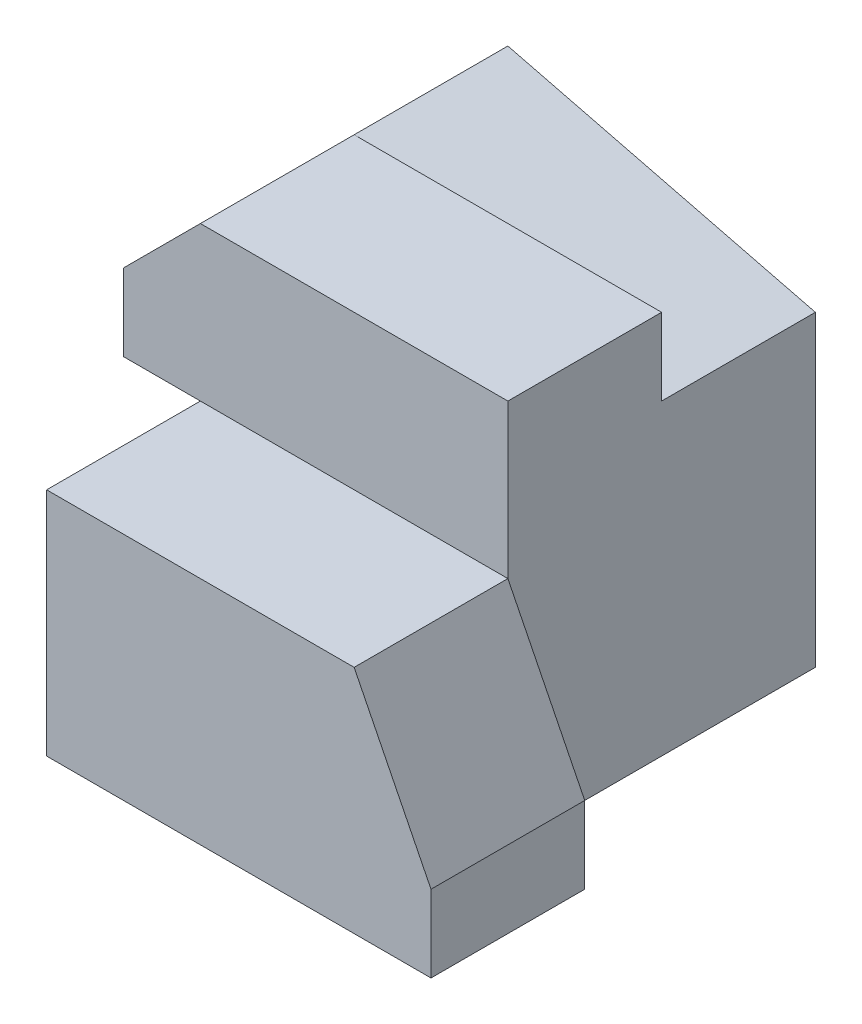
ISO-10303-21;
HEADER;
FILE_DESCRIPTION(('STEP AP214'),'2;1');
FILE_NAME('part.step','',(''),(''),'','','');
FILE_SCHEMA(('AUTOMOTIVE_DESIGN { 1 0 10303 214 1 1 1 1 }'));
ENDSEC;
DATA;
#1=APPLICATION_CONTEXT('core data for automotive mechanical design processes');
#2=APPLICATION_PROTOCOL_DEFINITION('international standard','automotive_design',2000,#1);
#3=PRODUCT_CONTEXT('',#1,'mechanical');
#4=PRODUCT('Part','Part','',(#3));
#5=PRODUCT_RELATED_PRODUCT_CATEGORY('part','',(#4));
#6=PRODUCT_DEFINITION_FORMATION('','',#4);
#7=PRODUCT_DEFINITION_CONTEXT('part definition',#1,'design');
#8=PRODUCT_DEFINITION('design','',#6,#7);
#9=PRODUCT_DEFINITION_SHAPE('','',#8);
#10=(LENGTH_UNIT() NAMED_UNIT(*) SI_UNIT(.MILLI.,.METRE.));
#11=(NAMED_UNIT(*) PLANE_ANGLE_UNIT() SI_UNIT($,.RADIAN.));
#12=(NAMED_UNIT(*) SI_UNIT($,.STERADIAN.) SOLID_ANGLE_UNIT());
#13=UNCERTAINTY_MEASURE_WITH_UNIT(LENGTH_MEASURE(1.E-05),#10,'distance_accuracy_value','');
#14=(GEOMETRIC_REPRESENTATION_CONTEXT(3) GLOBAL_UNCERTAINTY_ASSIGNED_CONTEXT((#13)) GLOBAL_UNIT_ASSIGNED_CONTEXT((#10,
#11,#12)) REPRESENTATION_CONTEXT('',''));
#15=CARTESIAN_POINT('',(0.,0.,0.));
#16=DIRECTION('',(0.,0.,1.));
#17=DIRECTION('',(1.,0.,0.));
#18=AXIS2_PLACEMENT_3D('',#15,#16,#17);
#19=CARTESIAN_POINT('',(0.,0.,-10.));
#20=DIRECTION('',(0.,0.,-1.));
#21=DIRECTION('',(-1.,0.,0.));
#22=AXIS2_PLACEMENT_3D('',#19,#20,#21);
#23=PLANE('',#22);
#24=DIRECTION('',(0.707106781186548,0.707106781186547,0.));
#25=VECTOR('',#24,1.);
#26=CARTESIAN_POINT('',(-25.,25.,-10.));
#27=LINE('',#26,#25);
#28=CARTESIAN_POINT('',(-30.,20.,-10.));
#29=VERTEX_POINT('',#28);
#30=CARTESIAN_POINT('',(-25.,25.,-10.));
#31=VERTEX_POINT('',#30);
#32=EDGE_CURVE('E313',#29,#31,#27,.T.);
#33=ORIENTED_EDGE('',*,*,#32,.T.);
#34=DIRECTION('',(0.,1.,0.));
#35=VECTOR('',#34,1.);
#36=CARTESIAN_POINT('',(-25.,25.,-10.));
#37=LINE('',#36,#35);
#38=CARTESIAN_POINT('',(-25.,20.,-10.));
#39=VERTEX_POINT('',#38);
#40=EDGE_CURVE('E333',#39,#31,#37,.T.);
#41=ORIENTED_EDGE('',*,*,#40,.F.);
#42=DIRECTION('',(1.,0.,0.));
#43=VECTOR('',#42,1.);
#44=CARTESIAN_POINT('',(-5.,20.,-10.));
#45=LINE('',#44,#43);
#46=EDGE_CURVE('E274',#29,#39,#45,.T.);
#47=ORIENTED_EDGE('',*,*,#46,.F.);
#48=EDGE_LOOP('',(#33,#41,#47));
#49=FACE_BOUND('',#48,.T.);
#50=ADVANCED_FACE('F33',(#49),#23,.T.);
#51=DIRECTION('',(0.,-1.,0.));
#52=VECTOR('',#51,1.);
#53=CARTESIAN_POINT('',(-5.,15.,-10.));
#54=LINE('',#53,#52);
#55=CARTESIAN_POINT('',(-5.,25.,-10.));
#56=VERTEX_POINT('',#55);
#57=CARTESIAN_POINT('',(-5.,20.,-10.));
#58=VERTEX_POINT('',#57);
#59=EDGE_CURVE('E164',#56,#58,#54,.T.);
#60=ORIENTED_EDGE('',*,*,#59,.T.);
#61=DIRECTION('',(0.970142500145332,-0.242535625036333,0.));
#62=VECTOR('',#61,1.);
#63=CARTESIAN_POINT('',(-5.,20.,-10.));
#64=LINE('',#63,#62);
#65=EDGE_CURVE('E266',#31,#58,#64,.T.);
#66=ORIENTED_EDGE('',*,*,#65,.F.);
#67=DIRECTION('',(1.,0.,0.));
#68=VECTOR('',#67,1.);
#69=CARTESIAN_POINT('',(-5.,25.,-10.));
#70=LINE('',#69,#68);
#71=EDGE_CURVE('E325',#31,#56,#70,.T.);
#72=ORIENTED_EDGE('',*,*,#71,.T.);
#73=EDGE_LOOP('',(#60,#66,#72));
#74=FACE_BOUND('',#73,.T.);
#75=ADVANCED_FACE('F347',(#74),#23,.T.);
#76=CARTESIAN_POINT('',(-5.,20.,-20.));
#77=DIRECTION('',(0.,-1.,0.));
#78=DIRECTION('',(0.,0.,-1.));
#79=AXIS2_PLACEMENT_3D('',#76,#77,#78);
#80=PLANE('',#79);
#81=DIRECTION('',(0.,0.,1.));
#82=VECTOR('',#81,1.);
#83=CARTESIAN_POINT('',(-25.,20.,-20.));
#84=LINE('',#83,#82);
#85=CARTESIAN_POINT('',(-25.,20.,-20.));
#86=VERTEX_POINT('',#85);
#87=EDGE_CURVE('E257',#86,#39,#84,.T.);
#88=ORIENTED_EDGE('',*,*,#87,.F.);
#89=DIRECTION('',(1.,0.,0.));
#90=VECTOR('',#89,1.);
#91=CARTESIAN_POINT('',(-5.,20.,-20.));
#92=LINE('',#91,#90);
#93=CARTESIAN_POINT('',(-30.,20.,-20.));
#94=VERTEX_POINT('',#93);
#95=EDGE_CURVE('E273',#94,#86,#92,.T.);
#96=ORIENTED_EDGE('',*,*,#95,.F.);
#97=DIRECTION('',(0.,0.,1.));
#98=VECTOR('',#97,1.);
#99=CARTESIAN_POINT('',(-30.,20.,-20.));
#100=LINE('',#99,#98);
#101=EDGE_CURVE('E284',#94,#29,#100,.T.);
#102=ORIENTED_EDGE('',*,*,#101,.T.);
#103=ORIENTED_EDGE('',*,*,#46,.T.);
#104=EDGE_LOOP('',(#88,#96,#102,#103));
#105=FACE_BOUND('',#104,.T.);
#106=ADVANCED_FACE('F271',(#105),#80,.F.);
#107=CARTESIAN_POINT('',(0.,0.,10.));
#108=DIRECTION('',(0.,1.,0.));
#109=DIRECTION('',(-1.,0.,0.));
#110=AXIS2_PLACEMENT_3D('',#107,#108,#109);
#111=PLANE('',#110);
#112=DIRECTION('',(0.,0.,-1.));
#113=VECTOR('',#112,1.);
#114=CARTESIAN_POINT('',(-25.,0.,10.));
#115=LINE('',#114,#113);
#116=CARTESIAN_POINT('',(-25.,0.,10.));
#117=VERTEX_POINT('',#116);
#118=CARTESIAN_POINT('',(-25.,0.,0.));
#119=VERTEX_POINT('',#118);
#120=EDGE_CURVE('E114',#117,#119,#115,.T.);
#121=ORIENTED_EDGE('',*,*,#120,.T.);
#122=DIRECTION('',(-1.,0.,0.));
#123=VECTOR('',#122,1.);
#124=CARTESIAN_POINT('',(-5.,0.,0.));
#125=LINE('',#124,#123);
#126=CARTESIAN_POINT('',(-30.,0.,0.));
#127=VERTEX_POINT('',#126);
#128=EDGE_CURVE('E131',#119,#127,#125,.T.);
#129=ORIENTED_EDGE('',*,*,#128,.T.);
#130=DIRECTION('',(0.,0.,1.));
#131=VECTOR('',#130,1.);
#132=CARTESIAN_POINT('',(-30.,0.,-10.));
#133=LINE('',#132,#131);
#134=CARTESIAN_POINT('',(-30.,0.,-20.));
#135=VERTEX_POINT('',#134);
#136=EDGE_CURVE('E147',#135,#127,#133,.T.);
#137=ORIENTED_EDGE('',*,*,#136,.F.);
#138=DIRECTION('',(-1.,0.,0.));
#139=VECTOR('',#138,1.);
#140=CARTESIAN_POINT('',(-5.,0.,-20.));
#141=LINE('',#140,#139);
#142=CARTESIAN_POINT('',(-5.,0.,-20.));
#143=VERTEX_POINT('',#142);
#144=EDGE_CURVE('E286',#143,#135,#141,.T.);
#145=ORIENTED_EDGE('',*,*,#144,.F.);
#146=DIRECTION('',(0.,0.,1.));
#147=VECTOR('',#146,1.);
#148=CARTESIAN_POINT('',(-5.,0.,-10.));
#149=LINE('',#148,#147);
#150=CARTESIAN_POINT('',(-5.,0.,0.));
#151=VERTEX_POINT('',#150);
#152=EDGE_CURVE('E125',#143,#151,#149,.T.);
#153=ORIENTED_EDGE('',*,*,#152,.T.);
#154=DIRECTION('',(1.,0.,0.));
#155=VECTOR('',#154,1.);
#156=CARTESIAN_POINT('',(0.,0.,0.));
#157=LINE('',#156,#155);
#158=CARTESIAN_POINT('',(0.,0.,0.));
#159=VERTEX_POINT('',#158);
#160=EDGE_CURVE('E123',#151,#159,#157,.T.);
#161=ORIENTED_EDGE('',*,*,#160,.T.);
#162=DIRECTION('',(0.,0.,-1.));
#163=VECTOR('',#162,1.);
#164=CARTESIAN_POINT('',(0.,0.,10.));
#165=LINE('',#164,#163);
#166=CARTESIAN_POINT('',(0.,0.,10.));
#167=VERTEX_POINT('',#166);
#168=EDGE_CURVE('E11',#167,#159,#165,.T.);
#169=ORIENTED_EDGE('',*,*,#168,.F.);
#170=DIRECTION('',(1.,0.,0.));
#171=VECTOR('',#170,1.);
#172=CARTESIAN_POINT('',(0.,0.,10.));
#173=LINE('',#172,#171);
#174=EDGE_CURVE('E149',#117,#167,#173,.T.);
#175=ORIENTED_EDGE('',*,*,#174,.F.);
#176=EDGE_LOOP('',(#121,#129,#137,#145,#153,#161,#169,#175));
#177=FACE_BOUND('',#176,.T.);
#178=ADVANCED_FACE('F35',(#177),#111,.F.);
#179=CARTESIAN_POINT('',(0.,5.,10.));
#180=DIRECTION('',(-1.,0.,0.));
#181=DIRECTION('',(0.,0.,1.));
#182=AXIS2_PLACEMENT_3D('',#179,#180,#181);
#183=PLANE('',#182);
#184=DIRECTION('',(0.,1.,0.));
#185=VECTOR('',#184,1.);
#186=CARTESIAN_POINT('',(0.,5.,0.));
#187=LINE('',#186,#185);
#188=CARTESIAN_POINT('',(0.,5.,0.));
#189=VERTEX_POINT('',#188);
#190=EDGE_CURVE('E120',#159,#189,#187,.T.);
#191=ORIENTED_EDGE('',*,*,#190,.T.);
#192=DIRECTION('',(0.,0.,-1.));
#193=VECTOR('',#192,1.);
#194=CARTESIAN_POINT('',(0.,5.,10.));
#195=LINE('',#194,#193);
#196=CARTESIAN_POINT('',(0.,5.,10.));
#197=VERTEX_POINT('',#196);
#198=EDGE_CURVE('E43',#197,#189,#195,.T.);
#199=ORIENTED_EDGE('',*,*,#198,.F.);
#200=DIRECTION('',(0.,1.,0.));
#201=VECTOR('',#200,1.);
#202=CARTESIAN_POINT('',(0.,5.,10.));
#203=LINE('',#202,#201);
#204=EDGE_CURVE('E85',#167,#197,#203,.T.);
#205=ORIENTED_EDGE('',*,*,#204,.F.);
#206=ORIENTED_EDGE('',*,*,#168,.T.);
#207=EDGE_LOOP('',(#191,#199,#205,#206));
#208=FACE_BOUND('',#207,.T.);
#209=ADVANCED_FACE('F365',(#208),#183,.F.);
#210=CARTESIAN_POINT('',(-5.,15.,10.));
#211=DIRECTION('',(-0.894427190999916,-0.447213595499958,0.));
#212=DIRECTION('',(0.447213595499958,-0.894427190999916,0.));
#213=AXIS2_PLACEMENT_3D('',#210,#211,#212);
#214=PLANE('',#213);
#215=DIRECTION('',(-0.447213595499958,0.894427190999916,0.));
#216=VECTOR('',#215,1.);
#217=CARTESIAN_POINT('',(-5.,15.,0.));
#218=LINE('',#217,#216);
#219=CARTESIAN_POINT('',(-5.,15.,0.));
#220=VERTEX_POINT('',#219);
#221=EDGE_CURVE('E107',#189,#220,#218,.T.);
#222=ORIENTED_EDGE('',*,*,#221,.T.);
#223=DIRECTION('',(0.,0.,-1.));
#224=VECTOR('',#223,1.);
#225=CARTESIAN_POINT('',(-5.,15.,10.));
#226=LINE('',#225,#224);
#227=CARTESIAN_POINT('',(-5.,15.,10.));
#228=VERTEX_POINT('',#227);
#229=EDGE_CURVE('E103',#228,#220,#226,.T.);
#230=ORIENTED_EDGE('',*,*,#229,.F.);
#231=DIRECTION('',(-0.447213595499958,0.894427190999916,0.));
#232=VECTOR('',#231,1.);
#233=CARTESIAN_POINT('',(-5.,15.,10.));
#234=LINE('',#233,#232);
#235=EDGE_CURVE('E92',#197,#228,#234,.T.);
#236=ORIENTED_EDGE('',*,*,#235,.F.);
#237=ORIENTED_EDGE('',*,*,#198,.T.);
#238=EDGE_LOOP('',(#222,#230,#236,#237));
#239=FACE_BOUND('',#238,.T.);
#240=ADVANCED_FACE('F104',(#239),#214,.F.);
#241=CARTESIAN_POINT('',(-25.,15.,10.));
#242=DIRECTION('',(0.,-1.,0.));
#243=DIRECTION('',(1.,0.,0.));
#244=AXIS2_PLACEMENT_3D('',#241,#242,#243);
#245=PLANE('',#244);
#246=ORIENTED_EDGE('',*,*,#229,.T.);
#247=DIRECTION('',(-1.,0.,0.));
#248=VECTOR('',#247,1.);
#249=CARTESIAN_POINT('',(-30.,15.,0.));
#250=LINE('',#249,#248);
#251=CARTESIAN_POINT('',(-25.,15.,0.));
#252=VERTEX_POINT('',#251);
#253=EDGE_CURVE('E296',#220,#252,#250,.T.);
#254=ORIENTED_EDGE('',*,*,#253,.T.);
#255=DIRECTION('',(0.,0.,-1.));
#256=VECTOR('',#255,1.);
#257=CARTESIAN_POINT('',(-25.,15.,10.));
#258=LINE('',#257,#256);
#259=CARTESIAN_POINT('',(-25.,15.,10.));
#260=VERTEX_POINT('',#259);
#261=EDGE_CURVE('E110',#260,#252,#258,.T.);
#262=ORIENTED_EDGE('',*,*,#261,.F.);
#263=DIRECTION('',(-1.,0.,0.));
#264=VECTOR('',#263,1.);
#265=CARTESIAN_POINT('',(-25.,15.,10.));
#266=LINE('',#265,#264);
#267=EDGE_CURVE('E96',#228,#260,#266,.T.);
#268=ORIENTED_EDGE('',*,*,#267,.F.);
#269=EDGE_LOOP('',(#246,#254,#262,#268));
#270=FACE_BOUND('',#269,.T.);
#271=ADVANCED_FACE('F112',(#270),#245,.F.);
#272=CARTESIAN_POINT('',(-25.,0.,10.));
#273=DIRECTION('',(1.,0.,0.));
#274=DIRECTION('',(0.,0.,-1.));
#275=AXIS2_PLACEMENT_3D('',#272,#273,#274);
#276=PLANE('',#275);
#277=DIRECTION('',(0.,-1.,0.));
#278=VECTOR('',#277,1.);
#279=CARTESIAN_POINT('',(-25.,0.,0.));
#280=LINE('',#279,#278);
#281=EDGE_CURVE('E77',#252,#119,#280,.T.);
#282=ORIENTED_EDGE('',*,*,#281,.T.);
#283=ORIENTED_EDGE('',*,*,#120,.F.);
#284=DIRECTION('',(0.,-1.,0.));
#285=VECTOR('',#284,1.);
#286=CARTESIAN_POINT('',(-25.,0.,10.));
#287=LINE('',#286,#285);
#288=EDGE_CURVE('E52',#260,#117,#287,.T.);
#289=ORIENTED_EDGE('',*,*,#288,.F.);
#290=ORIENTED_EDGE('',*,*,#261,.T.);
#291=EDGE_LOOP('',(#282,#283,#289,#290));
#292=FACE_BOUND('',#291,.T.);
#293=ADVANCED_FACE('F391',(#292),#276,.F.);
#294=CARTESIAN_POINT('',(0.,0.,10.));
#295=DIRECTION('',(0.,0.,-1.));
#296=DIRECTION('',(-1.,0.,0.));
#297=AXIS2_PLACEMENT_3D('',#294,#295,#296);
#298=PLANE('',#297);
#299=ORIENTED_EDGE('',*,*,#174,.T.);
#300=ORIENTED_EDGE('',*,*,#204,.T.);
#301=ORIENTED_EDGE('',*,*,#235,.T.);
#302=ORIENTED_EDGE('',*,*,#267,.T.);
#303=ORIENTED_EDGE('',*,*,#288,.T.);
#304=EDGE_LOOP('',(#299,#300,#301,#302,#303));
#305=FACE_BOUND('',#304,.T.);
#306=ADVANCED_FACE('F94',(#305),#298,.F.);
#307=CARTESIAN_POINT('',(0.,0.,0.));
#308=DIRECTION('',(0.,0.,-1.));
#309=DIRECTION('',(-1.,0.,0.));
#310=AXIS2_PLACEMENT_3D('',#307,#308,#309);
#311=PLANE('',#310);
#312=DIRECTION('',(0.,-1.,0.));
#313=VECTOR('',#312,1.);
#314=CARTESIAN_POINT('',(-5.,15.,0.));
#315=LINE('',#314,#313);
#316=EDGE_CURVE('E127',#220,#151,#315,.T.);
#317=ORIENTED_EDGE('',*,*,#316,.F.);
#318=ORIENTED_EDGE('',*,*,#221,.F.);
#319=ORIENTED_EDGE('',*,*,#190,.F.);
#320=ORIENTED_EDGE('',*,*,#160,.F.);
#321=EDGE_LOOP('',(#317,#318,#319,#320));
#322=FACE_BOUND('',#321,.T.);
#323=ADVANCED_FACE('F364',(#322),#311,.T.);
#324=CARTESIAN_POINT('',(-5.,15.,-10.));
#325=DIRECTION('',(-1.,0.,0.));
#326=DIRECTION('',(0.,0.,1.));
#327=AXIS2_PLACEMENT_3D('',#324,#325,#326);
#328=PLANE('',#327);
#329=ORIENTED_EDGE('',*,*,#316,.T.);
#330=ORIENTED_EDGE('',*,*,#152,.F.);
#331=DIRECTION('',(0.,-1.,0.));
#332=VECTOR('',#331,1.);
#333=CARTESIAN_POINT('',(-5.,0.,-20.));
#334=LINE('',#333,#332);
#335=CARTESIAN_POINT('',(-5.,20.,-20.));
#336=VERTEX_POINT('',#335);
#337=EDGE_CURVE('E357',#336,#143,#334,.T.);
#338=ORIENTED_EDGE('',*,*,#337,.F.);
#339=DIRECTION('',(0.,0.,1.));
#340=VECTOR('',#339,1.);
#341=CARTESIAN_POINT('',(-5.,20.,-20.));
#342=LINE('',#341,#340);
#343=EDGE_CURVE('E281',#336,#58,#342,.T.);
#344=ORIENTED_EDGE('',*,*,#343,.T.);
#345=ORIENTED_EDGE('',*,*,#59,.F.);
#346=DIRECTION('',(0.,0.,-1.));
#347=VECTOR('',#346,1.);
#348=CARTESIAN_POINT('',(-5.,25.,0.));
#349=LINE('',#348,#347);
#350=CARTESIAN_POINT('',(-5.,25.,0.));
#351=VERTEX_POINT('',#350);
#352=EDGE_CURVE('E132',#351,#56,#349,.T.);
#353=ORIENTED_EDGE('',*,*,#352,.F.);
#354=DIRECTION('',(0.,-1.,0.));
#355=VECTOR('',#354,1.);
#356=CARTESIAN_POINT('',(-5.,15.,0.));
#357=LINE('',#356,#355);
#358=EDGE_CURVE('E307',#351,#220,#357,.T.);
#359=ORIENTED_EDGE('',*,*,#358,.T.);
#360=EDGE_LOOP('',(#329,#330,#338,#344,#345,#353,#359));
#361=FACE_BOUND('',#360,.T.);
#362=ADVANCED_FACE('F344',(#361),#328,.F.);
#363=CARTESIAN_POINT('',(-30.,0.,-10.));
#364=DIRECTION('',(1.,0.,0.));
#365=DIRECTION('',(0.,0.,-1.));
#366=AXIS2_PLACEMENT_3D('',#363,#364,#365);
#367=PLANE('',#366);
#368=DIRECTION('',(0.,1.,0.));
#369=VECTOR('',#368,1.);
#370=CARTESIAN_POINT('',(-30.,0.,0.));
#371=LINE('',#370,#369);
#372=CARTESIAN_POINT('',(-30.,5.,0.));
#373=VERTEX_POINT('',#372);
#374=EDGE_CURVE('E141',#127,#373,#371,.T.);
#375=ORIENTED_EDGE('',*,*,#374,.T.);
#376=DIRECTION('',(0.,0.,1.));
#377=VECTOR('',#376,1.);
#378=CARTESIAN_POINT('',(-30.,5.,-10.));
#379=LINE('',#378,#377);
#380=CARTESIAN_POINT('',(-30.,5.,-10.));
#381=VERTEX_POINT('',#380);
#382=EDGE_CURVE('E168',#381,#373,#379,.T.);
#383=ORIENTED_EDGE('',*,*,#382,.F.);
#384=DIRECTION('',(0.,1.,0.));
#385=VECTOR('',#384,1.);
#386=CARTESIAN_POINT('',(-30.,0.,-10.));
#387=LINE('',#386,#385);
#388=CARTESIAN_POINT('',(-30.,15.,-10.));
#389=VERTEX_POINT('',#388);
#390=EDGE_CURVE('E275',#381,#389,#387,.T.);
#391=ORIENTED_EDGE('',*,*,#390,.T.);
#392=DIRECTION('',(0.,0.,-1.));
#393=VECTOR('',#392,1.);
#394=CARTESIAN_POINT('',(-30.,15.,0.));
#395=LINE('',#394,#393);
#396=CARTESIAN_POINT('',(-30.,15.,0.));
#397=VERTEX_POINT('',#396);
#398=EDGE_CURVE('E310',#397,#389,#395,.T.);
#399=ORIENTED_EDGE('',*,*,#398,.F.);
#400=DIRECTION('',(0.,1.,0.));
#401=VECTOR('',#400,1.);
#402=CARTESIAN_POINT('',(-30.,20.,0.));
#403=LINE('',#402,#401);
#404=CARTESIAN_POINT('',(-30.,20.,0.));
#405=VERTEX_POINT('',#404);
#406=EDGE_CURVE('E298',#397,#405,#403,.T.);
#407=ORIENTED_EDGE('',*,*,#406,.T.);
#408=DIRECTION('',(0.,0.,-1.));
#409=VECTOR('',#408,1.);
#410=CARTESIAN_POINT('',(-30.,20.,0.));
#411=LINE('',#410,#409);
#412=EDGE_CURVE('E318',#405,#29,#411,.T.);
#413=ORIENTED_EDGE('',*,*,#412,.T.);
#414=ORIENTED_EDGE('',*,*,#101,.F.);
#415=DIRECTION('',(0.,1.,0.));
#416=VECTOR('',#415,1.);
#417=CARTESIAN_POINT('',(-30.,0.,-20.));
#418=LINE('',#417,#416);
#419=EDGE_CURVE('E279',#135,#94,#418,.T.);
#420=ORIENTED_EDGE('',*,*,#419,.F.);
#421=ORIENTED_EDGE('',*,*,#136,.T.);
#422=EDGE_LOOP('',(#375,#383,#391,#399,#407,#413,#414,#420,#421));
#423=FACE_BOUND('',#422,.T.);
#424=ADVANCED_FACE('F183',(#423),#367,.F.);
#425=CARTESIAN_POINT('',(-30.,5.,-10.));
#426=DIRECTION('',(0.894427190999916,-0.447213595499958,0.));
#427=DIRECTION('',(0.447213595499958,0.894427190999916,0.));
#428=AXIS2_PLACEMENT_3D('',#425,#426,#427);
#429=PLANE('',#428);
#430=DIRECTION('',(0.447213595499958,0.894427190999916,0.));
#431=VECTOR('',#430,1.);
#432=CARTESIAN_POINT('',(-30.,5.,0.));
#433=LINE('',#432,#431);
#434=EDGE_CURVE('E171',#373,#252,#433,.T.);
#435=ORIENTED_EDGE('',*,*,#434,.T.);
#436=DIRECTION('',(0.,0.,1.));
#437=VECTOR('',#436,1.);
#438=CARTESIAN_POINT('',(-25.,15.,-10.));
#439=LINE('',#438,#437);
#440=CARTESIAN_POINT('',(-25.,15.,-10.));
#441=VERTEX_POINT('',#440);
#442=EDGE_CURVE('E163',#441,#252,#439,.T.);
#443=ORIENTED_EDGE('',*,*,#442,.F.);
#444=DIRECTION('',(0.447213595499958,0.894427190999916,0.));
#445=VECTOR('',#444,1.);
#446=CARTESIAN_POINT('',(-30.,5.,-10.));
#447=LINE('',#446,#445);
#448=EDGE_CURVE('E160',#381,#441,#447,.T.);
#449=ORIENTED_EDGE('',*,*,#448,.F.);
#450=ORIENTED_EDGE('',*,*,#382,.T.);
#451=EDGE_LOOP('',(#435,#443,#449,#450));
#452=FACE_BOUND('',#451,.T.);
#453=ADVANCED_FACE('F191',(#452),#429,.F.);
#454=CARTESIAN_POINT('',(0.,0.,0.));
#455=DIRECTION('',(0.,0.,-1.));
#456=DIRECTION('',(-1.,0.,0.));
#457=AXIS2_PLACEMENT_3D('',#454,#455,#456);
#458=PLANE('',#457);
#459=ORIENTED_EDGE('',*,*,#281,.F.);
#460=ORIENTED_EDGE('',*,*,#434,.F.);
#461=ORIENTED_EDGE('',*,*,#374,.F.);
#462=ORIENTED_EDGE('',*,*,#128,.F.);
#463=EDGE_LOOP('',(#459,#460,#461,#462));
#464=FACE_BOUND('',#463,.T.);
#465=ADVANCED_FACE('F194',(#464),#458,.F.);
#466=CARTESIAN_POINT('',(-30.,15.,0.));
#467=DIRECTION('',(0.,-1.,0.));
#468=DIRECTION('',(1.,0.,0.));
#469=AXIS2_PLACEMENT_3D('',#466,#467,#468);
#470=PLANE('',#469);
#471=DIRECTION('',(-1.,0.,0.));
#472=VECTOR('',#471,1.);
#473=CARTESIAN_POINT('',(-30.,15.,-10.));
#474=LINE('',#473,#472);
#475=EDGE_CURVE('E315',#441,#389,#474,.T.);
#476=ORIENTED_EDGE('',*,*,#475,.F.);
#477=ORIENTED_EDGE('',*,*,#442,.T.);
#478=EDGE_CURVE('E70',#252,#397,#250,.T.);
#479=ORIENTED_EDGE('',*,*,#478,.T.);
#480=ORIENTED_EDGE('',*,*,#398,.T.);
#481=EDGE_LOOP('',(#476,#477,#479,#480));
#482=FACE_BOUND('',#481,.T.);
#483=ADVANCED_FACE('F379',(#482),#470,.T.);
#484=CARTESIAN_POINT('',(-5.,25.,0.));
#485=DIRECTION('',(0.,1.,0.));
#486=DIRECTION('',(0.,0.,1.));
#487=AXIS2_PLACEMENT_3D('',#484,#485,#486);
#488=PLANE('',#487);
#489=ORIENTED_EDGE('',*,*,#71,.F.);
#490=DIRECTION('',(0.,0.,-1.));
#491=VECTOR('',#490,1.);
#492=CARTESIAN_POINT('',(-25.,25.,0.));
#493=LINE('',#492,#491);
#494=CARTESIAN_POINT('',(-25.,25.,0.));
#495=VERTEX_POINT('',#494);
#496=EDGE_CURVE('E321',#495,#31,#493,.T.);
#497=ORIENTED_EDGE('',*,*,#496,.F.);
#498=DIRECTION('',(1.,0.,0.));
#499=VECTOR('',#498,1.);
#500=CARTESIAN_POINT('',(-5.,25.,0.));
#501=LINE('',#500,#499);
#502=EDGE_CURVE('E304',#495,#351,#501,.T.);
#503=ORIENTED_EDGE('',*,*,#502,.T.);
#504=ORIENTED_EDGE('',*,*,#352,.T.);
#505=EDGE_LOOP('',(#489,#497,#503,#504));
#506=FACE_BOUND('',#505,.T.);
#507=ADVANCED_FACE('F342',(#506),#488,.T.);
#508=CARTESIAN_POINT('',(-25.,25.,0.));
#509=DIRECTION('',(-0.707106781186547,0.707106781186548,0.));
#510=DIRECTION('',(-0.707106781186548,-0.707106781186547,0.));
#511=AXIS2_PLACEMENT_3D('',#508,#509,#510);
#512=PLANE('',#511);
#513=ORIENTED_EDGE('',*,*,#32,.F.);
#514=ORIENTED_EDGE('',*,*,#412,.F.);
#515=DIRECTION('',(0.707106781186548,0.707106781186547,0.));
#516=VECTOR('',#515,1.);
#517=CARTESIAN_POINT('',(-25.,25.,0.));
#518=LINE('',#517,#516);
#519=EDGE_CURVE('E301',#405,#495,#518,.T.);
#520=ORIENTED_EDGE('',*,*,#519,.T.);
#521=ORIENTED_EDGE('',*,*,#496,.T.);
#522=EDGE_LOOP('',(#513,#514,#520,#521));
#523=FACE_BOUND('',#522,.T.);
#524=ADVANCED_FACE('F335',(#523),#512,.T.);
#525=CARTESIAN_POINT('',(0.,0.,0.));
#526=DIRECTION('',(0.,0.,1.));
#527=DIRECTION('',(1.,0.,0.));
#528=AXIS2_PLACEMENT_3D('',#525,#526,#527);
#529=PLANE('',#528);
#530=ORIENTED_EDGE('',*,*,#253,.F.);
#531=ORIENTED_EDGE('',*,*,#358,.F.);
#532=ORIENTED_EDGE('',*,*,#502,.F.);
#533=ORIENTED_EDGE('',*,*,#519,.F.);
#534=ORIENTED_EDGE('',*,*,#406,.F.);
#535=ORIENTED_EDGE('',*,*,#478,.F.);
#536=EDGE_LOOP('',(#530,#531,#532,#533,#534,#535));
#537=FACE_BOUND('',#536,.T.);
#538=ADVANCED_FACE('F338',(#537),#529,.T.);
#539=CARTESIAN_POINT('',(0.,0.,-20.));
#540=DIRECTION('',(0.,0.,1.));
#541=DIRECTION('',(1.,0.,0.));
#542=AXIS2_PLACEMENT_3D('',#539,#540,#541);
#543=PLANE('',#542);
#544=ORIENTED_EDGE('',*,*,#337,.T.);
#545=ORIENTED_EDGE('',*,*,#144,.T.);
#546=ORIENTED_EDGE('',*,*,#419,.T.);
#547=ORIENTED_EDGE('',*,*,#95,.T.);
#548=DIRECTION('',(0.,1.,0.));
#549=VECTOR('',#548,1.);
#550=CARTESIAN_POINT('',(-25.,25.,-20.));
#551=LINE('',#550,#549);
#552=CARTESIAN_POINT('',(-25.,25.,-20.));
#553=VERTEX_POINT('',#552);
#554=EDGE_CURVE('E254',#86,#553,#551,.T.);
#555=ORIENTED_EDGE('',*,*,#554,.T.);
#556=DIRECTION('',(0.970142500145332,-0.242535625036333,0.));
#557=VECTOR('',#556,1.);
#558=CARTESIAN_POINT('',(-5.,20.,-20.));
#559=LINE('',#558,#557);
#560=EDGE_CURVE('E265',#553,#336,#559,.T.);
#561=ORIENTED_EDGE('',*,*,#560,.T.);
#562=EDGE_LOOP('',(#544,#545,#546,#547,#555,#561));
#563=FACE_BOUND('',#562,.T.);
#564=ADVANCED_FACE('F278',(#563),#543,.F.);
#565=CARTESIAN_POINT('',(0.,0.,-10.));
#566=DIRECTION('',(0.,0.,1.));
#567=DIRECTION('',(1.,0.,0.));
#568=AXIS2_PLACEMENT_3D('',#565,#566,#567);
#569=PLANE('',#568);
#570=ORIENTED_EDGE('',*,*,#390,.F.);
#571=ORIENTED_EDGE('',*,*,#448,.T.);
#572=ORIENTED_EDGE('',*,*,#475,.T.);
#573=EDGE_LOOP('',(#570,#571,#572));
#574=FACE_BOUND('',#573,.T.);
#575=ADVANCED_FACE('F461',(#574),#569,.T.);
#576=CARTESIAN_POINT('',(-25.,25.,-20.));
#577=DIRECTION('',(1.,0.,0.));
#578=DIRECTION('',(0.,0.,-1.));
#579=AXIS2_PLACEMENT_3D('',#576,#577,#578);
#580=PLANE('',#579);
#581=ORIENTED_EDGE('',*,*,#40,.T.);
#582=DIRECTION('',(0.,0.,1.));
#583=VECTOR('',#582,1.);
#584=CARTESIAN_POINT('',(-25.,25.,-20.));
#585=LINE('',#584,#583);
#586=EDGE_CURVE('E260',#553,#31,#585,.T.);
#587=ORIENTED_EDGE('',*,*,#586,.F.);
#588=ORIENTED_EDGE('',*,*,#554,.F.);
#589=ORIENTED_EDGE('',*,*,#87,.T.);
#590=EDGE_LOOP('',(#581,#587,#588,#589));
#591=FACE_BOUND('',#590,.T.);
#592=ADVANCED_FACE('F256',(#591),#580,.F.);
#593=CARTESIAN_POINT('',(-5.,20.,-20.));
#594=DIRECTION('',(-0.242535625036333,-0.970142500145332,0.));
#595=DIRECTION('',(0.970142500145332,-0.242535625036333,0.));
#596=AXIS2_PLACEMENT_3D('',#593,#594,#595);
#597=PLANE('',#596);
#598=ORIENTED_EDGE('',*,*,#65,.T.);
#599=ORIENTED_EDGE('',*,*,#343,.F.);
#600=ORIENTED_EDGE('',*,*,#560,.F.);
#601=ORIENTED_EDGE('',*,*,#586,.T.);
#602=EDGE_LOOP('',(#598,#599,#600,#601));
#603=FACE_BOUND('',#602,.T.);
#604=ADVANCED_FACE('F474',(#603),#597,.F.);
#605=CLOSED_SHELL('',(#50,#75,#106,#178,#209,#240,#271,#293,#306,#323,#362,#424,#453,#465,#483,
#507,#524,#538,#564,#575,#592,#604));
#606=MANIFOLD_SOLID_BREP('B2',#605);
#607=ADVANCED_BREP_SHAPE_REPRESENTATION('',(#18,#606),#14);
#608=SHAPE_DEFINITION_REPRESENTATION(#9,#607);
ENDSEC;
END-ISO-10303-21;
